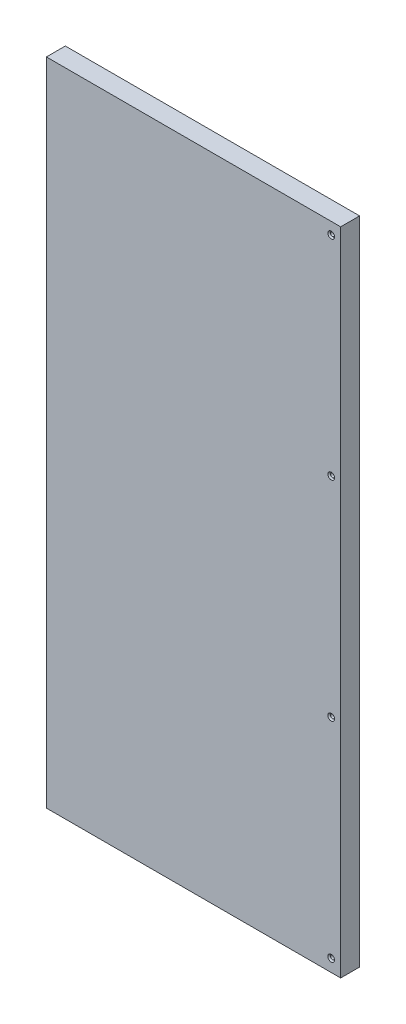
ISO-10303-21;
HEADER;
FILE_DESCRIPTION(('STEP AP214'),'2;1');
FILE_NAME('part.step','',(''),(''),'','','');
FILE_SCHEMA(('AUTOMOTIVE_DESIGN { 1 0 10303 214 1 1 1 1 }'));
ENDSEC;
DATA;
#1=APPLICATION_CONTEXT('core data for automotive mechanical design processes');
#2=APPLICATION_PROTOCOL_DEFINITION('international standard','automotive_design',2000,#1);
#3=PRODUCT_CONTEXT('',#1,'mechanical');
#4=PRODUCT('Part','Part','',(#3));
#5=PRODUCT_RELATED_PRODUCT_CATEGORY('part','',(#4));
#6=PRODUCT_DEFINITION_FORMATION('','',#4);
#7=PRODUCT_DEFINITION_CONTEXT('part definition',#1,'design');
#8=PRODUCT_DEFINITION('design','',#6,#7);
#9=PRODUCT_DEFINITION_SHAPE('','',#8);
#10=(LENGTH_UNIT() NAMED_UNIT(*) SI_UNIT(.MILLI.,.METRE.));
#11=(NAMED_UNIT(*) PLANE_ANGLE_UNIT() SI_UNIT($,.RADIAN.));
#12=(NAMED_UNIT(*) SI_UNIT($,.STERADIAN.) SOLID_ANGLE_UNIT());
#13=UNCERTAINTY_MEASURE_WITH_UNIT(LENGTH_MEASURE(1.E-05),#10,'distance_accuracy_value','');
#14=(GEOMETRIC_REPRESENTATION_CONTEXT(3) GLOBAL_UNCERTAINTY_ASSIGNED_CONTEXT((#13)) GLOBAL_UNIT_ASSIGNED_CONTEXT((#10,
#11,#12)) REPRESENTATION_CONTEXT('',''));
#15=CARTESIAN_POINT('',(0.,0.,0.));
#16=DIRECTION('',(0.,0.,1.));
#17=DIRECTION('',(1.,0.,0.));
#18=AXIS2_PLACEMENT_3D('',#15,#16,#17);
#19=CARTESIAN_POINT('',(116.39,265.,16.));
#20=DIRECTION('',(0.,0.,1.));
#21=DIRECTION('',(1.,0.,0.));
#22=AXIS2_PLACEMENT_3D('',#19,#20,#21);
#23=CONICAL_SURFACE('',#22,2.8575,0.872664625997159);
#24=CARTESIAN_POINT('',(116.39,265.,14.9716414470107));
#25=DIRECTION('',(0.,0.,1.));
#26=DIRECTION('',(1.,0.,0.));
#27=AXIS2_PLACEMENT_3D('',#24,#25,#26);
#28=CIRCLE('',#27,1.63194999999999);
#29=CARTESIAN_POINT('',(118.02195,265.,14.9716414470107));
#30=VERTEX_POINT('',#29);
#31=EDGE_CURVE('E11',#30,#30,#28,.T.);
#32=ORIENTED_EDGE('',*,*,#31,.F.);
#33=EDGE_LOOP('',(#32));
#34=FACE_BOUND('',#33,.T.);
#35=CARTESIAN_POINT('',(116.39,265.,16.));
#36=DIRECTION('',(0.,0.,1.));
#37=DIRECTION('',(1.,0.,0.));
#38=AXIS2_PLACEMENT_3D('',#35,#36,#37);
#39=CIRCLE('',#38,2.8575);
#40=CARTESIAN_POINT('',(119.2475,265.,16.));
#41=VERTEX_POINT('',#40);
#42=EDGE_CURVE('E129',#41,#41,#39,.T.);
#43=ORIENTED_EDGE('',*,*,#42,.T.);
#44=EDGE_LOOP('',(#43));
#45=FACE_BOUND('',#44,.T.);
#46=ADVANCED_FACE('F39',(#34,#45),#23,.F.);
#47=CARTESIAN_POINT('',(116.39,265.,16.));
#48=DIRECTION('',(0.,0.,1.));
#49=DIRECTION('',(1.,0.,0.));
#50=AXIS2_PLACEMENT_3D('',#47,#48,#49);
#51=CYLINDRICAL_SURFACE('',#50,1.63194999999999);
#52=ORIENTED_EDGE('',*,*,#31,.T.);
#53=EDGE_LOOP('',(#52));
#54=FACE_BOUND('',#53,.T.);
#55=CARTESIAN_POINT('',(116.39,265.,0.));
#56=DIRECTION('',(0.,0.,-1.));
#57=DIRECTION('',(-1.,0.,0.));
#58=AXIS2_PLACEMENT_3D('',#55,#56,#57);
#59=CIRCLE('',#58,1.63194999999999);
#60=CARTESIAN_POINT('',(114.75805,265.,0.));
#61=VERTEX_POINT('',#60);
#62=EDGE_CURVE('E47',#61,#61,#59,.T.);
#63=ORIENTED_EDGE('',*,*,#62,.T.);
#64=EDGE_LOOP('',(#63));
#65=FACE_BOUND('',#64,.T.);
#66=ADVANCED_FACE('F134',(#54,#65),#51,.F.);
#67=CARTESIAN_POINT('',(116.39,88.5,16.));
#68=DIRECTION('',(0.,0.,1.));
#69=DIRECTION('',(1.,0.,0.));
#70=AXIS2_PLACEMENT_3D('',#67,#68,#69);
#71=CONICAL_SURFACE('',#70,2.8575,0.872664625997159);
#72=CARTESIAN_POINT('',(116.39,88.5,14.9716414470107));
#73=DIRECTION('',(0.,0.,1.));
#74=DIRECTION('',(1.,0.,0.));
#75=AXIS2_PLACEMENT_3D('',#72,#73,#74);
#76=CIRCLE('',#75,1.63194999999999);
#77=CARTESIAN_POINT('',(118.02195,88.5,14.9716414470107));
#78=VERTEX_POINT('',#77);
#79=EDGE_CURVE('E126',#78,#78,#76,.T.);
#80=ORIENTED_EDGE('',*,*,#79,.F.);
#81=EDGE_LOOP('',(#80));
#82=FACE_BOUND('',#81,.T.);
#83=CARTESIAN_POINT('',(116.39,88.5,16.));
#84=DIRECTION('',(0.,0.,1.));
#85=DIRECTION('',(1.,0.,0.));
#86=AXIS2_PLACEMENT_3D('',#83,#84,#85);
#87=CIRCLE('',#86,2.8575);
#88=CARTESIAN_POINT('',(119.2475,88.5,16.));
#89=VERTEX_POINT('',#88);
#90=EDGE_CURVE('E118',#89,#89,#87,.T.);
#91=ORIENTED_EDGE('',*,*,#90,.T.);
#92=EDGE_LOOP('',(#91));
#93=FACE_BOUND('',#92,.T.);
#94=ADVANCED_FACE('F159',(#82,#93),#71,.F.);
#95=CARTESIAN_POINT('',(116.39,88.5,16.));
#96=DIRECTION('',(0.,0.,1.));
#97=DIRECTION('',(1.,0.,0.));
#98=AXIS2_PLACEMENT_3D('',#95,#96,#97);
#99=CYLINDRICAL_SURFACE('',#98,1.63194999999999);
#100=ORIENTED_EDGE('',*,*,#79,.T.);
#101=EDGE_LOOP('',(#100));
#102=FACE_BOUND('',#101,.T.);
#103=CARTESIAN_POINT('',(116.39,88.5,0.));
#104=DIRECTION('',(0.,0.,-1.));
#105=DIRECTION('',(-1.,0.,0.));
#106=AXIS2_PLACEMENT_3D('',#103,#104,#105);
#107=CIRCLE('',#106,1.63194999999999);
#108=CARTESIAN_POINT('',(114.75805,88.5,0.));
#109=VERTEX_POINT('',#108);
#110=EDGE_CURVE('E123',#109,#109,#107,.T.);
#111=ORIENTED_EDGE('',*,*,#110,.T.);
#112=EDGE_LOOP('',(#111));
#113=FACE_BOUND('',#112,.T.);
#114=ADVANCED_FACE('F168',(#102,#113),#99,.F.);
#115=CARTESIAN_POINT('',(-124.39,275.,16.));
#116=DIRECTION('',(0.,1.,0.));
#117=DIRECTION('',(0.,0.,1.));
#118=AXIS2_PLACEMENT_3D('',#115,#116,#117);
#119=PLANE('',#118);
#120=DIRECTION('',(1.,0.,0.));
#121=VECTOR('',#120,1.);
#122=CARTESIAN_POINT('',(-124.39,275.,0.));
#123=LINE('',#122,#121);
#124=CARTESIAN_POINT('',(-124.39,275.,0.));
#125=VERTEX_POINT('',#124);
#126=CARTESIAN_POINT('',(124.39,275.,0.));
#127=VERTEX_POINT('',#126);
#128=EDGE_CURVE('E109',#125,#127,#123,.T.);
#129=ORIENTED_EDGE('',*,*,#128,.F.);
#130=DIRECTION('',(0.,0.,-1.));
#131=VECTOR('',#130,1.);
#132=CARTESIAN_POINT('',(-124.39,275.,16.));
#133=LINE('',#132,#131);
#134=CARTESIAN_POINT('',(-124.39,275.,16.));
#135=VERTEX_POINT('',#134);
#136=EDGE_CURVE('E55',#135,#125,#133,.T.);
#137=ORIENTED_EDGE('',*,*,#136,.F.);
#138=DIRECTION('',(1.,0.,0.));
#139=VECTOR('',#138,1.);
#140=CARTESIAN_POINT('',(-124.39,275.,16.));
#141=LINE('',#140,#139);
#142=CARTESIAN_POINT('',(124.39,275.,16.));
#143=VERTEX_POINT('',#142);
#144=EDGE_CURVE('E103',#135,#143,#141,.T.);
#145=ORIENTED_EDGE('',*,*,#144,.T.);
#146=DIRECTION('',(0.,0.,-1.));
#147=VECTOR('',#146,1.);
#148=CARTESIAN_POINT('',(124.39,275.,16.));
#149=LINE('',#148,#147);
#150=EDGE_CURVE('E80',#143,#127,#149,.T.);
#151=ORIENTED_EDGE('',*,*,#150,.T.);
#152=EDGE_LOOP('',(#129,#137,#145,#151));
#153=FACE_BOUND('',#152,.T.);
#154=ADVANCED_FACE('F174',(#153),#119,.T.);
#155=CARTESIAN_POINT('',(-124.39,275.,16.));
#156=DIRECTION('',(1.,0.,0.));
#157=DIRECTION('',(0.,0.,-1.));
#158=AXIS2_PLACEMENT_3D('',#155,#156,#157);
#159=PLANE('',#158);
#160=DIRECTION('',(0.,-1.,0.));
#161=VECTOR('',#160,1.);
#162=CARTESIAN_POINT('',(-124.39,275.,0.));
#163=LINE('',#162,#161);
#164=CARTESIAN_POINT('',(-124.39,-275.,0.));
#165=VERTEX_POINT('',#164);
#166=EDGE_CURVE('E72',#125,#165,#163,.T.);
#167=ORIENTED_EDGE('',*,*,#166,.T.);
#168=DIRECTION('',(0.,0.,-1.));
#169=VECTOR('',#168,1.);
#170=CARTESIAN_POINT('',(-124.39,-275.,16.));
#171=LINE('',#170,#169);
#172=CARTESIAN_POINT('',(-124.39,-275.,16.));
#173=VERTEX_POINT('',#172);
#174=EDGE_CURVE('E100',#173,#165,#171,.T.);
#175=ORIENTED_EDGE('',*,*,#174,.F.);
#176=DIRECTION('',(0.,-1.,0.));
#177=VECTOR('',#176,1.);
#178=CARTESIAN_POINT('',(-124.39,275.,16.));
#179=LINE('',#178,#177);
#180=EDGE_CURVE('E91',#135,#173,#179,.T.);
#181=ORIENTED_EDGE('',*,*,#180,.F.);
#182=ORIENTED_EDGE('',*,*,#136,.T.);
#183=EDGE_LOOP('',(#167,#175,#181,#182));
#184=FACE_BOUND('',#183,.T.);
#185=ADVANCED_FACE('F178',(#184),#159,.F.);
#186=CARTESIAN_POINT('',(-124.39,-275.,16.));
#187=DIRECTION('',(0.,1.,0.));
#188=DIRECTION('',(0.,0.,1.));
#189=AXIS2_PLACEMENT_3D('',#186,#187,#188);
#190=PLANE('',#189);
#191=DIRECTION('',(1.,0.,0.));
#192=VECTOR('',#191,1.);
#193=CARTESIAN_POINT('',(-124.39,-275.,0.));
#194=LINE('',#193,#192);
#195=CARTESIAN_POINT('',(124.39,-275.,0.));
#196=VERTEX_POINT('',#195);
#197=EDGE_CURVE('E98',#165,#196,#194,.T.);
#198=ORIENTED_EDGE('',*,*,#197,.T.);
#199=DIRECTION('',(0.,0.,-1.));
#200=VECTOR('',#199,1.);
#201=CARTESIAN_POINT('',(124.39,-275.,16.));
#202=LINE('',#201,#200);
#203=CARTESIAN_POINT('',(124.39,-275.,16.));
#204=VERTEX_POINT('',#203);
#205=EDGE_CURVE('E95',#204,#196,#202,.T.);
#206=ORIENTED_EDGE('',*,*,#205,.F.);
#207=DIRECTION('',(1.,0.,0.));
#208=VECTOR('',#207,1.);
#209=CARTESIAN_POINT('',(-124.39,-275.,16.));
#210=LINE('',#209,#208);
#211=EDGE_CURVE('E85',#173,#204,#210,.T.);
#212=ORIENTED_EDGE('',*,*,#211,.F.);
#213=ORIENTED_EDGE('',*,*,#174,.T.);
#214=EDGE_LOOP('',(#198,#206,#212,#213));
#215=FACE_BOUND('',#214,.T.);
#216=ADVANCED_FACE('F96',(#215),#190,.F.);
#217=CARTESIAN_POINT('',(124.39,275.,16.));
#218=DIRECTION('',(1.,0.,0.));
#219=DIRECTION('',(0.,0.,-1.));
#220=AXIS2_PLACEMENT_3D('',#217,#218,#219);
#221=PLANE('',#220);
#222=DIRECTION('',(0.,-1.,0.));
#223=VECTOR('',#222,1.);
#224=CARTESIAN_POINT('',(124.39,275.,0.));
#225=LINE('',#224,#223);
#226=EDGE_CURVE('E112',#127,#196,#225,.T.);
#227=ORIENTED_EDGE('',*,*,#226,.F.);
#228=ORIENTED_EDGE('',*,*,#150,.F.);
#229=DIRECTION('',(0.,-1.,0.));
#230=VECTOR('',#229,1.);
#231=CARTESIAN_POINT('',(124.39,275.,16.));
#232=LINE('',#231,#230);
#233=EDGE_CURVE('E90',#143,#204,#232,.T.);
#234=ORIENTED_EDGE('',*,*,#233,.T.);
#235=ORIENTED_EDGE('',*,*,#205,.T.);
#236=EDGE_LOOP('',(#227,#228,#234,#235));
#237=FACE_BOUND('',#236,.T.);
#238=ADVANCED_FACE('F102',(#237),#221,.T.);
#239=CARTESIAN_POINT('',(0.,0.,16.));
#240=DIRECTION('',(0.,0.,-1.));
#241=DIRECTION('',(-1.,0.,0.));
#242=AXIS2_PLACEMENT_3D('',#239,#240,#241);
#243=PLANE('',#242);
#244=CARTESIAN_POINT('',(116.39,-88.,16.));
#245=DIRECTION('',(0.,0.,1.));
#246=DIRECTION('',(1.,0.,0.));
#247=AXIS2_PLACEMENT_3D('',#244,#245,#246);
#248=CIRCLE('',#247,2.8575);
#249=CARTESIAN_POINT('',(119.2475,-88.,16.));
#250=VERTEX_POINT('',#249);
#251=EDGE_CURVE('E267',#250,#250,#248,.T.);
#252=ORIENTED_EDGE('',*,*,#251,.F.);
#253=EDGE_LOOP('',(#252));
#254=FACE_BOUND('',#253,.T.);
#255=CARTESIAN_POINT('',(116.39,-264.5,16.));
#256=DIRECTION('',(0.,0.,1.));
#257=DIRECTION('',(1.,0.,0.));
#258=AXIS2_PLACEMENT_3D('',#255,#256,#257);
#259=CIRCLE('',#258,2.8575);
#260=CARTESIAN_POINT('',(119.2475,-264.5,16.));
#261=VERTEX_POINT('',#260);
#262=EDGE_CURVE('E274',#261,#261,#259,.T.);
#263=ORIENTED_EDGE('',*,*,#262,.F.);
#264=EDGE_LOOP('',(#263));
#265=FACE_BOUND('',#264,.T.);
#266=ORIENTED_EDGE('',*,*,#144,.F.);
#267=ORIENTED_EDGE('',*,*,#180,.T.);
#268=ORIENTED_EDGE('',*,*,#211,.T.);
#269=ORIENTED_EDGE('',*,*,#233,.F.);
#270=EDGE_LOOP('',(#266,#267,#268,#269));
#271=FACE_BOUND('',#270,.T.);
#272=ORIENTED_EDGE('',*,*,#90,.F.);
#273=EDGE_LOOP('',(#272));
#274=FACE_BOUND('',#273,.T.);
#275=ORIENTED_EDGE('',*,*,#42,.F.);
#276=EDGE_LOOP('',(#275));
#277=FACE_BOUND('',#276,.T.);
#278=ADVANCED_FACE('F88',(#254,#265,#271,#274,#277),#243,.F.);
#279=CARTESIAN_POINT('',(0.,0.,0.));
#280=DIRECTION('',(0.,0.,-1.));
#281=DIRECTION('',(-1.,0.,0.));
#282=AXIS2_PLACEMENT_3D('',#279,#280,#281);
#283=PLANE('',#282);
#284=CARTESIAN_POINT('',(116.39,-88.,0.));
#285=DIRECTION('',(0.,0.,-1.));
#286=DIRECTION('',(-1.,0.,0.));
#287=AXIS2_PLACEMENT_3D('',#284,#285,#286);
#288=CIRCLE('',#287,1.63194999999999);
#289=CARTESIAN_POINT('',(114.75805,-88.,0.));
#290=VERTEX_POINT('',#289);
#291=EDGE_CURVE('E268',#290,#290,#288,.T.);
#292=ORIENTED_EDGE('',*,*,#291,.F.);
#293=EDGE_LOOP('',(#292));
#294=FACE_BOUND('',#293,.T.);
#295=CARTESIAN_POINT('',(116.39,-264.5,0.));
#296=DIRECTION('',(0.,0.,-1.));
#297=DIRECTION('',(-1.,0.,0.));
#298=AXIS2_PLACEMENT_3D('',#295,#296,#297);
#299=CIRCLE('',#298,1.63194999999999);
#300=CARTESIAN_POINT('',(114.75805,-264.5,0.));
#301=VERTEX_POINT('',#300);
#302=EDGE_CURVE('E113',#301,#301,#299,.T.);
#303=ORIENTED_EDGE('',*,*,#302,.F.);
#304=EDGE_LOOP('',(#303));
#305=FACE_BOUND('',#304,.T.);
#306=ORIENTED_EDGE('',*,*,#128,.T.);
#307=ORIENTED_EDGE('',*,*,#226,.T.);
#308=ORIENTED_EDGE('',*,*,#197,.F.);
#309=ORIENTED_EDGE('',*,*,#166,.F.);
#310=EDGE_LOOP('',(#306,#307,#308,#309));
#311=FACE_BOUND('',#310,.T.);
#312=ORIENTED_EDGE('',*,*,#110,.F.);
#313=EDGE_LOOP('',(#312));
#314=FACE_BOUND('',#313,.T.);
#315=ORIENTED_EDGE('',*,*,#62,.F.);
#316=EDGE_LOOP('',(#315));
#317=FACE_BOUND('',#316,.T.);
#318=ADVANCED_FACE('F136',(#294,#305,#311,#314,#317),#283,.T.);
#319=CARTESIAN_POINT('',(116.39,-264.5,16.));
#320=DIRECTION('',(0.,0.,1.));
#321=DIRECTION('',(1.,0.,0.));
#322=AXIS2_PLACEMENT_3D('',#319,#320,#321);
#323=CYLINDRICAL_SURFACE('',#322,1.63194999999999);
#324=CARTESIAN_POINT('',(116.39,-264.5,14.9716414470107));
#325=DIRECTION('',(0.,0.,1.));
#326=DIRECTION('',(1.,0.,0.));
#327=AXIS2_PLACEMENT_3D('',#324,#325,#326);
#328=CIRCLE('',#327,1.63194999999999);
#329=CARTESIAN_POINT('',(118.02195,-264.5,14.9716414470107));
#330=VERTEX_POINT('',#329);
#331=EDGE_CURVE('E277',#330,#330,#328,.T.);
#332=ORIENTED_EDGE('',*,*,#331,.T.);
#333=EDGE_LOOP('',(#332));
#334=FACE_BOUND('',#333,.T.);
#335=ORIENTED_EDGE('',*,*,#302,.T.);
#336=EDGE_LOOP('',(#335));
#337=FACE_BOUND('',#336,.T.);
#338=ADVANCED_FACE('F138',(#334,#337),#323,.F.);
#339=CARTESIAN_POINT('',(116.39,-264.5,16.));
#340=DIRECTION('',(0.,0.,1.));
#341=DIRECTION('',(1.,0.,0.));
#342=AXIS2_PLACEMENT_3D('',#339,#340,#341);
#343=CONICAL_SURFACE('',#342,2.8575,0.872664625997159);
#344=ORIENTED_EDGE('',*,*,#331,.F.);
#345=EDGE_LOOP('',(#344));
#346=FACE_BOUND('',#345,.T.);
#347=ORIENTED_EDGE('',*,*,#262,.T.);
#348=EDGE_LOOP('',(#347));
#349=FACE_BOUND('',#348,.T.);
#350=ADVANCED_FACE('F146',(#346,#349),#343,.F.);
#351=CARTESIAN_POINT('',(116.39,-88.,16.));
#352=DIRECTION('',(0.,0.,1.));
#353=DIRECTION('',(1.,0.,0.));
#354=AXIS2_PLACEMENT_3D('',#351,#352,#353);
#355=CYLINDRICAL_SURFACE('',#354,1.63194999999999);
#356=CARTESIAN_POINT('',(116.39,-88.,14.9716414470107));
#357=DIRECTION('',(0.,0.,1.));
#358=DIRECTION('',(1.,0.,0.));
#359=AXIS2_PLACEMENT_3D('',#356,#357,#358);
#360=CIRCLE('',#359,1.63194999999999);
#361=CARTESIAN_POINT('',(118.02195,-88.,14.9716414470107));
#362=VERTEX_POINT('',#361);
#363=EDGE_CURVE('E264',#362,#362,#360,.T.);
#364=ORIENTED_EDGE('',*,*,#363,.T.);
#365=EDGE_LOOP('',(#364));
#366=FACE_BOUND('',#365,.T.);
#367=ORIENTED_EDGE('',*,*,#291,.T.);
#368=EDGE_LOOP('',(#367));
#369=FACE_BOUND('',#368,.T.);
#370=ADVANCED_FACE('F219',(#366,#369),#355,.F.);
#371=CARTESIAN_POINT('',(116.39,-88.,16.));
#372=DIRECTION('',(0.,0.,1.));
#373=DIRECTION('',(1.,0.,0.));
#374=AXIS2_PLACEMENT_3D('',#371,#372,#373);
#375=CONICAL_SURFACE('',#374,2.8575,0.872664625997159);
#376=ORIENTED_EDGE('',*,*,#363,.F.);
#377=EDGE_LOOP('',(#376));
#378=FACE_BOUND('',#377,.T.);
#379=ORIENTED_EDGE('',*,*,#251,.T.);
#380=EDGE_LOOP('',(#379));
#381=FACE_BOUND('',#380,.T.);
#382=ADVANCED_FACE('F244',(#378,#381),#375,.F.);
#383=CLOSED_SHELL('',(#46,#66,#94,#114,#154,#185,#216,#238,#278,#318,#338,#350,#370,#382));
#384=MANIFOLD_SOLID_BREP('B2',#383);
#385=ADVANCED_BREP_SHAPE_REPRESENTATION('',(#18,#384),#14);
#386=SHAPE_DEFINITION_REPRESENTATION(#9,#385);
ENDSEC;
END-ISO-10303-21;
